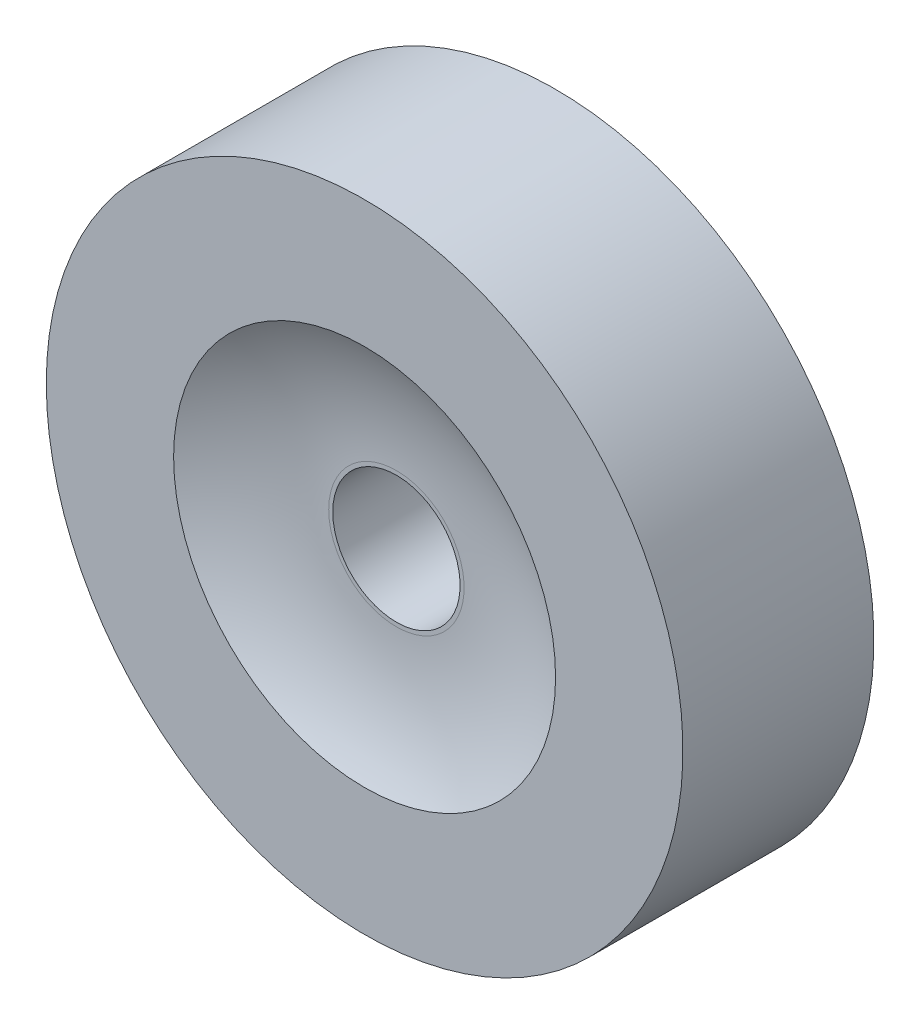
ISO-10303-21;
HEADER;
FILE_DESCRIPTION(('STEP AP214'),'2;1');
FILE_NAME('part.step','',(''),(''),'','','');
FILE_SCHEMA(('AUTOMOTIVE_DESIGN { 1 0 10303 214 1 1 1 1 }'));
ENDSEC;
DATA;
#1=APPLICATION_CONTEXT('core data for automotive mechanical design processes');
#2=APPLICATION_PROTOCOL_DEFINITION('international standard','automotive_design',2000,#1);
#3=PRODUCT_CONTEXT('',#1,'mechanical');
#4=PRODUCT('Part','Part','',(#3));
#5=PRODUCT_RELATED_PRODUCT_CATEGORY('part','',(#4));
#6=PRODUCT_DEFINITION_FORMATION('','',#4);
#7=PRODUCT_DEFINITION_CONTEXT('part definition',#1,'design');
#8=PRODUCT_DEFINITION('design','',#6,#7);
#9=PRODUCT_DEFINITION_SHAPE('','',#8);
#10=(LENGTH_UNIT() NAMED_UNIT(*) SI_UNIT(.MILLI.,.METRE.));
#11=(NAMED_UNIT(*) PLANE_ANGLE_UNIT() SI_UNIT($,.RADIAN.));
#12=(NAMED_UNIT(*) SI_UNIT($,.STERADIAN.) SOLID_ANGLE_UNIT());
#13=UNCERTAINTY_MEASURE_WITH_UNIT(LENGTH_MEASURE(1.E-05),#10,'distance_accuracy_value','');
#14=(GEOMETRIC_REPRESENTATION_CONTEXT(3) GLOBAL_UNCERTAINTY_ASSIGNED_CONTEXT((#13)) GLOBAL_UNIT_ASSIGNED_CONTEXT((#10,
#11,#12)) REPRESENTATION_CONTEXT('',''));
#15=CARTESIAN_POINT('',(0.,0.,0.));
#16=DIRECTION('',(0.,0.,1.));
#17=DIRECTION('',(1.,0.,0.));
#18=AXIS2_PLACEMENT_3D('',#15,#16,#17);
#19=CARTESIAN_POINT('',(7.18439152004204,-7.8054276100069,0.200000000000006));
#20=DIRECTION('',(0.,0.,-1.));
#21=DIRECTION('',(-1.,0.,0.));
#22=AXIS2_PLACEMENT_3D('',#19,#20,#21);
#23=PLANE('',#22);
#24=CARTESIAN_POINT('',(7.08439152004204,-7.8054276100069,0.200000000000006));
#25=DIRECTION('',(0.,0.,-1.));
#26=DIRECTION('',(-1.,0.,0.));
#27=AXIS2_PLACEMENT_3D('',#24,#25,#26);
#28=CIRCLE('',#27,0.5);
#29=CARTESIAN_POINT('',(6.58439152004204,-7.8054276100069,0.200000000000006));
#30=VERTEX_POINT('',#29);
#31=EDGE_CURVE('E52',#30,#30,#28,.T.);
#32=ORIENTED_EDGE('',*,*,#31,.T.);
#33=EDGE_LOOP('',(#32));
#34=FACE_BOUND('',#33,.T.);
#35=CARTESIAN_POINT('',(7.08439152004204,-7.8054276100069,0.200000000000006));
#36=DIRECTION('',(0.,0.,-1.));
#37=DIRECTION('',(-1.,0.,0.));
#38=AXIS2_PLACEMENT_3D('',#35,#36,#37);
#39=CIRCLE('',#38,0.100000000000001);
#40=CARTESIAN_POINT('',(6.98439152004204,-7.8054276100069,0.200000000000006));
#41=VERTEX_POINT('',#40);
#42=EDGE_CURVE('E10',#41,#41,#39,.T.);
#43=ORIENTED_EDGE('',*,*,#42,.F.);
#44=EDGE_LOOP('',(#43));
#45=FACE_BOUND('',#44,.T.);
#46=ADVANCED_FACE('F30',(#34,#45),#23,.T.);
#47=CARTESIAN_POINT('',(7.08439152004204,-7.8054276100069,0.500000000000006));
#48=DIRECTION('',(0.,0.,-1.));
#49=DIRECTION('',(-1.,0.,0.));
#50=AXIS2_PLACEMENT_3D('',#47,#48,#49);
#51=CYLINDRICAL_SURFACE('',#50,0.100000000000001);
#52=ORIENTED_EDGE('',*,*,#42,.T.);
#53=EDGE_LOOP('',(#52));
#54=FACE_BOUND('',#53,.T.);
#55=CARTESIAN_POINT('',(7.08439152004204,-7.8054276100069,0.450000000000006));
#56=DIRECTION('',(0.,0.,-1.));
#57=DIRECTION('',(-1.,0.,0.));
#58=AXIS2_PLACEMENT_3D('',#55,#56,#57);
#59=CIRCLE('',#58,0.100000000000001);
#60=CARTESIAN_POINT('',(6.98439152004204,-7.8054276100069,0.450000000000006));
#61=VERTEX_POINT('',#60);
#62=EDGE_CURVE('E36',#61,#61,#59,.T.);
#63=ORIENTED_EDGE('',*,*,#62,.F.);
#64=EDGE_LOOP('',(#63));
#65=FACE_BOUND('',#64,.T.);
#66=ADVANCED_FACE('F70',(#54,#65),#51,.F.);
#67=CARTESIAN_POINT('',(7.19074235273167,-7.8054276100069,0.450000000000006));
#68=DIRECTION('',(0.,0.,1.));
#69=DIRECTION('',(1.,0.,0.));
#70=AXIS2_PLACEMENT_3D('',#67,#68,#69);
#71=PLANE('',#70);
#72=ORIENTED_EDGE('',*,*,#62,.T.);
#73=EDGE_LOOP('',(#72));
#74=FACE_BOUND('',#73,.T.);
#75=CARTESIAN_POINT('',(7.08439152004204,-7.8054276100069,0.450000000000006));
#76=DIRECTION('',(0.,0.,-1.));
#77=DIRECTION('',(-1.,0.,0.));
#78=AXIS2_PLACEMENT_3D('',#75,#76,#77);
#79=CIRCLE('',#78,0.106350832689629);
#80=CARTESIAN_POINT('',(6.97804068735241,-7.8054276100069,0.450000000000006));
#81=VERTEX_POINT('',#80);
#82=EDGE_CURVE('E40',#81,#81,#79,.T.);
#83=ORIENTED_EDGE('',*,*,#82,.F.);
#84=EDGE_LOOP('',(#83));
#85=FACE_BOUND('',#84,.T.);
#86=ADVANCED_FACE('F74',(#74,#85),#71,.T.);
#87=CARTESIAN_POINT('',(7.08439152004204,-7.8054276100069,0.850000000000006));
#88=DIRECTION('',(0.,0.,-1.));
#89=DIRECTION('',(-1.,0.,0.));
#90=AXIS2_PLACEMENT_3D('',#87,#88,#89);
#91=DEGENERATE_TOROIDAL_SURFACE('',#90,0.106350832689629,0.4,.T.);
#92=ORIENTED_EDGE('',*,*,#82,.T.);
#93=EDGE_LOOP('',(#92));
#94=FACE_BOUND('',#93,.T.);
#95=CARTESIAN_POINT('',(7.08439152004204,-7.8054276100069,0.500000000000006));
#96=DIRECTION('',(0.,0.,-1.));
#97=DIRECTION('',(-1.,0.,0.));
#98=AXIS2_PLACEMENT_3D('',#95,#96,#97);
#99=CIRCLE('',#98,0.3);
#100=CARTESIAN_POINT('',(6.78439152004204,-7.8054276100069,0.500000000000006));
#101=VERTEX_POINT('',#100);
#102=EDGE_CURVE('E44',#101,#101,#99,.T.);
#103=ORIENTED_EDGE('',*,*,#102,.F.);
#104=EDGE_LOOP('',(#103));
#105=FACE_BOUND('',#104,.T.);
#106=ADVANCED_FACE('F66',(#94,#105),#91,.F.);
#107=CARTESIAN_POINT('',(7.58439152004204,-7.8054276100069,0.500000000000006));
#108=DIRECTION('',(0.,0.,1.));
#109=DIRECTION('',(1.,0.,0.));
#110=AXIS2_PLACEMENT_3D('',#107,#108,#109);
#111=PLANE('',#110);
#112=ORIENTED_EDGE('',*,*,#102,.T.);
#113=EDGE_LOOP('',(#112));
#114=FACE_BOUND('',#113,.T.);
#115=CARTESIAN_POINT('',(7.08439152004204,-7.8054276100069,0.500000000000006));
#116=DIRECTION('',(0.,0.,-1.));
#117=DIRECTION('',(-1.,0.,0.));
#118=AXIS2_PLACEMENT_3D('',#115,#116,#117);
#119=CIRCLE('',#118,0.5);
#120=CARTESIAN_POINT('',(6.58439152004204,-7.8054276100069,0.500000000000006));
#121=VERTEX_POINT('',#120);
#122=EDGE_CURVE('E49',#121,#121,#119,.T.);
#123=ORIENTED_EDGE('',*,*,#122,.F.);
#124=EDGE_LOOP('',(#123));
#125=FACE_BOUND('',#124,.T.);
#126=ADVANCED_FACE('F60',(#114,#125),#111,.T.);
#127=CARTESIAN_POINT('',(7.08439152004204,-7.8054276100069,0.500000000000006));
#128=DIRECTION('',(0.,0.,-1.));
#129=DIRECTION('',(-1.,0.,0.));
#130=AXIS2_PLACEMENT_3D('',#127,#128,#129);
#131=CYLINDRICAL_SURFACE('',#130,0.5);
#132=ORIENTED_EDGE('',*,*,#122,.T.);
#133=EDGE_LOOP('',(#132));
#134=FACE_BOUND('',#133,.T.);
#135=ORIENTED_EDGE('',*,*,#31,.F.);
#136=EDGE_LOOP('',(#135));
#137=FACE_BOUND('',#136,.T.);
#138=ADVANCED_FACE('F58',(#134,#137),#131,.T.);
#139=CLOSED_SHELL('',(#46,#66,#86,#106,#126,#138));
#140=MANIFOLD_SOLID_BREP('B2',#139);
#141=ADVANCED_BREP_SHAPE_REPRESENTATION('',(#18,#140),#14);
#142=SHAPE_DEFINITION_REPRESENTATION(#9,#141);
ENDSEC;
END-ISO-10303-21;
